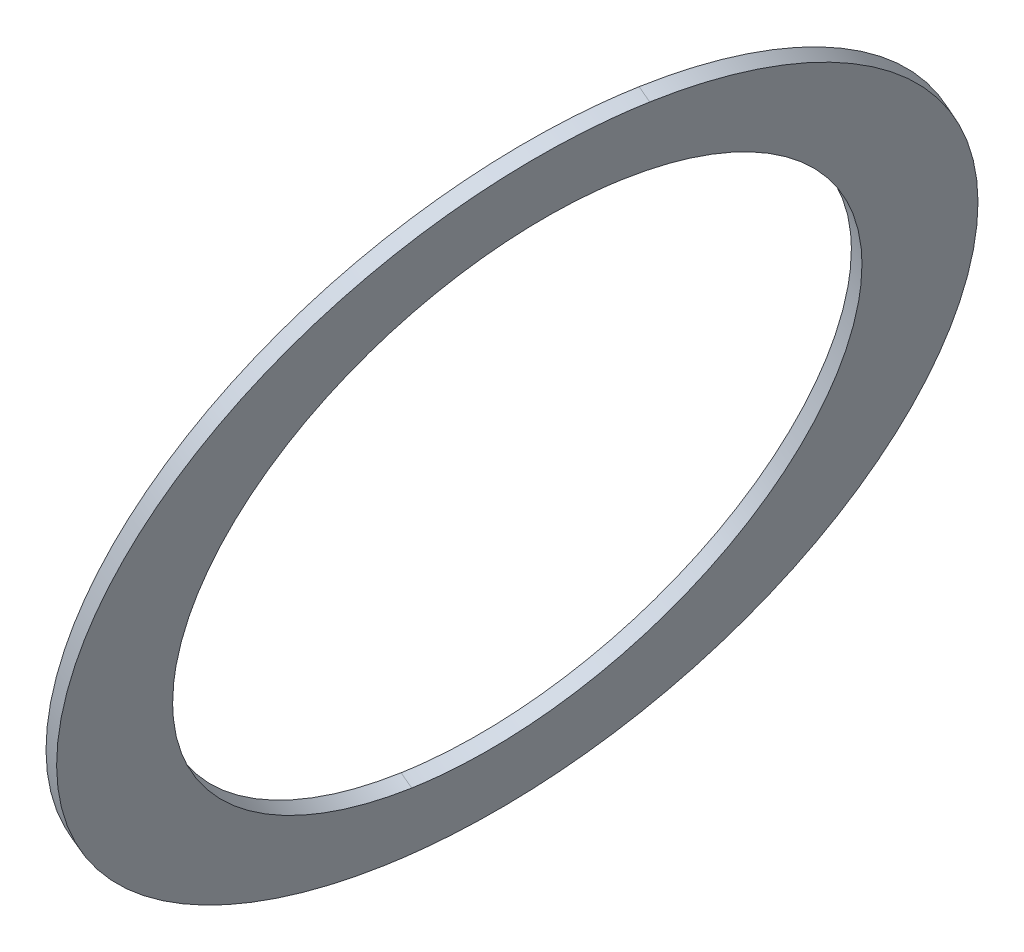
ISO-10303-21;
HEADER;
FILE_DESCRIPTION(('STEP AP214'),'2;1');
FILE_NAME('part.step','',(''),(''),'','','');
FILE_SCHEMA(('AUTOMOTIVE_DESIGN { 1 0 10303 214 1 1 1 1 }'));
ENDSEC;
DATA;
#1=APPLICATION_CONTEXT('core data for automotive mechanical design processes');
#2=APPLICATION_PROTOCOL_DEFINITION('international standard','automotive_design',2000,#1);
#3=PRODUCT_CONTEXT('',#1,'mechanical');
#4=PRODUCT('Part','Part','',(#3));
#5=PRODUCT_RELATED_PRODUCT_CATEGORY('part','',(#4));
#6=PRODUCT_DEFINITION_FORMATION('','',#4);
#7=PRODUCT_DEFINITION_CONTEXT('part definition',#1,'design');
#8=PRODUCT_DEFINITION('design','',#6,#7);
#9=PRODUCT_DEFINITION_SHAPE('','',#8);
#10=(LENGTH_UNIT() NAMED_UNIT(*) SI_UNIT(.MILLI.,.METRE.));
#11=(NAMED_UNIT(*) PLANE_ANGLE_UNIT() SI_UNIT($,.RADIAN.));
#12=(NAMED_UNIT(*) SI_UNIT($,.STERADIAN.) SOLID_ANGLE_UNIT());
#13=UNCERTAINTY_MEASURE_WITH_UNIT(LENGTH_MEASURE(1.E-05),#10,'distance_accuracy_value','');
#14=(GEOMETRIC_REPRESENTATION_CONTEXT(3) GLOBAL_UNCERTAINTY_ASSIGNED_CONTEXT((#13)) GLOBAL_UNIT_ASSIGNED_CONTEXT((#10,
#11,#12)) REPRESENTATION_CONTEXT('',''));
#15=CARTESIAN_POINT('',(0.,0.,0.));
#16=DIRECTION('',(0.,0.,1.));
#17=DIRECTION('',(1.,0.,0.));
#18=AXIS2_PLACEMENT_3D('',#15,#16,#17);
#19=CARTESIAN_POINT('',(-139.752487383921,70.7213654572873,-141.644211209351));
#20=CARTESIAN_POINT('',(-139.726119777532,70.7236637722229,-141.777262892946));
#21=CARTESIAN_POINT('',(-139.713229157618,70.6921218066896,-141.913488386246));
#22=CARTESIAN_POINT('',(-139.716476709013,70.626245339839,-142.04003074755));
#23=CARTESIAN_POINT('',(-139.754191040764,70.4155388145096,-142.301694580602));
#24=CARTESIAN_POINT('',(-139.850115538806,70.1138208715342,-142.456888314534));
#25=CARTESIAN_POINT('',(-139.920185079117,69.9219127484334,-142.508179353527));
#26=CARTESIAN_POINT('',(-140.054600427018,69.5897932797036,-142.528082146046));
#27=CARTESIAN_POINT('',(-140.199218907103,69.2892221478231,-142.425817143849));
#28=CARTESIAN_POINT('',(-140.25991642539,69.1731278579059,-142.360979551296));
#29=CARTESIAN_POINT('',(-140.349709533376,69.0202052321117,-142.224048410949));
#30=CARTESIAN_POINT('',(-140.422557749178,68.9296902859519,-142.039852227249));
#31=CARTESIAN_POINT('',(-140.445560045358,68.9068244483227,-141.96923830726));
#32=CARTESIAN_POINT('',(-140.464759160968,68.894715174402,-141.895098881138));
#33=CARTESIAN_POINT('',(-140.47966266488,68.8934161203519,-141.819895381166));
#34=B_SPLINE_CURVE_WITH_KNOTS('',5,(#19,#20,#21,#22,#23,#24,#25,#26,#27,#28,#29,#30,#31,#32,
#33),.UNSPECIFIED.,.F.,.F.,(6,3,3,3,6),(0.,0.249030806593906,0.604169804570402,0.8592427562129,
1.),.UNSPECIFIED.);
#35=DIRECTION('',(-0.909215143405846,0.378383579710355,-0.173648177666983));
#36=VECTOR('',#35,1.);
#37=SURFACE_OF_LINEAR_EXTRUSION('',#34,#36);
#38=DIRECTION('',(-0.909215143405846,0.378383579710355,-0.173648177666983));
#39=VECTOR('',#38,1.);
#40=CARTESIAN_POINT('',(-139.766125611072,70.7270412109829,-141.646815932016));
#41=LINE('',#40,#39);
#42=CARTESIAN_POINT('',(-139.752487383921,70.7213654572873,-141.644211209351));
#43=VERTEX_POINT('',#42);
#44=CARTESIAN_POINT('',(-139.779763838223,70.7327169646786,-141.649420654681));
#45=VERTEX_POINT('',#44);
#46=EDGE_CURVE('E41',#43,#45,#41,.T.);
#47=ORIENTED_EDGE('',*,*,#46,.F.);
#48=CARTESIAN_POINT('',(-139.752487383921,70.7213654572873,-141.644211209351));
#49=CARTESIAN_POINT('',(-139.726119777532,70.7236637722229,-141.777262892946));
#50=CARTESIAN_POINT('',(-139.713229157618,70.6921218066896,-141.913488386246));
#51=CARTESIAN_POINT('',(-139.716476709013,70.626245339839,-142.04003074755));
#52=CARTESIAN_POINT('',(-139.754191040764,70.4155388145096,-142.301694580602));
#53=CARTESIAN_POINT('',(-139.850115538806,70.1138208715342,-142.456888314534));
#54=CARTESIAN_POINT('',(-139.920185079117,69.9219127484334,-142.508179353527));
#55=CARTESIAN_POINT('',(-140.054600427018,69.5897932797036,-142.528082146046));
#56=CARTESIAN_POINT('',(-140.199218907103,69.2892221478231,-142.425817143849));
#57=CARTESIAN_POINT('',(-140.25991642539,69.1731278579059,-142.360979551296));
#58=CARTESIAN_POINT('',(-140.349709533376,69.0202052321117,-142.224048410949));
#59=CARTESIAN_POINT('',(-140.422557749178,68.9296902859519,-142.039852227249));
#60=CARTESIAN_POINT('',(-140.445560045358,68.9068244483227,-141.96923830726));
#61=CARTESIAN_POINT('',(-140.464759160968,68.894715174402,-141.895098881138));
#62=CARTESIAN_POINT('',(-140.47966266488,68.8934161203519,-141.819895381166));
#63=B_SPLINE_CURVE_WITH_KNOTS('',5,(#48,#49,#50,#51,#52,#53,#54,#55,#56,#57,#58,#59,#60,#61,
#62),.UNSPECIFIED.,.F.,.F.,(6,3,3,3,6),(0.,0.249030806593906,0.604169804570402,0.8592427562129,
1.),.UNSPECIFIED.);
#64=CARTESIAN_POINT('',(-140.47966266488,68.8934161203519,-141.819895381166));
#65=VERTEX_POINT('',#64);
#66=EDGE_CURVE('E11',#43,#65,#63,.T.);
#67=ORIENTED_EDGE('',*,*,#66,.T.);
#68=DIRECTION('',(-0.909215143405846,0.378383579710355,-0.173648177666983));
#69=VECTOR('',#68,1.);
#70=CARTESIAN_POINT('',(-140.493300892031,68.8990918740476,-141.822500103831));
#71=LINE('',#70,#69);
#72=CARTESIAN_POINT('',(-140.506939119182,68.9047676277433,-141.825104826496));
#73=VERTEX_POINT('',#72);
#74=EDGE_CURVE('E33',#65,#73,#71,.T.);
#75=ORIENTED_EDGE('',*,*,#74,.T.);
#76=CARTESIAN_POINT('',(-139.779763838223,70.7327169646786,-141.649420654681));
#77=CARTESIAN_POINT('',(-139.753396231834,70.7350152796143,-141.782472338276));
#78=CARTESIAN_POINT('',(-139.74050561192,70.7034733140809,-141.918697831576));
#79=CARTESIAN_POINT('',(-139.743753163315,70.6375968472303,-142.04524019288));
#80=CARTESIAN_POINT('',(-139.781467495066,70.4268903219009,-142.306904025932));
#81=CARTESIAN_POINT('',(-139.877391993108,70.1251723789255,-142.462097759864));
#82=CARTESIAN_POINT('',(-139.947461533419,69.9332642558247,-142.513388798857));
#83=CARTESIAN_POINT('',(-140.081876881321,69.6011447870949,-142.533291591376));
#84=CARTESIAN_POINT('',(-140.226495361405,69.3005736552144,-142.431026589179));
#85=CARTESIAN_POINT('',(-140.287192879692,69.1844793652972,-142.366188996626));
#86=CARTESIAN_POINT('',(-140.376985987678,69.031556739503,-142.229257856279));
#87=CARTESIAN_POINT('',(-140.44983420348,68.9410417933433,-142.045061672579));
#88=CARTESIAN_POINT('',(-140.47283649966,68.918175955714,-141.97444775259));
#89=CARTESIAN_POINT('',(-140.49203561527,68.9060666817934,-141.900308326468));
#90=CARTESIAN_POINT('',(-140.506939119182,68.9047676277433,-141.825104826496));
#91=B_SPLINE_CURVE_WITH_KNOTS('',5,(#76,#77,#78,#79,#80,#81,#82,#83,#84,#85,#86,#87,#88,#89,
#90),.UNSPECIFIED.,.F.,.F.,(6,3,3,3,6),(0.,0.249030806593906,0.604169804570402,0.8592427562129,
1.),.UNSPECIFIED.);
#92=EDGE_CURVE('E67',#45,#73,#91,.T.);
#93=ORIENTED_EDGE('',*,*,#92,.F.);
#94=EDGE_LOOP('',(#47,#67,#75,#93));
#95=FACE_BOUND('',#94,.T.);
#96=ADVANCED_FACE('F17',(#95),#37,.T.);
#97=CARTESIAN_POINT('',(-140.47966266488,68.8934161203519,-141.819895381166));
#98=CARTESIAN_POINT('',(-140.506030271268,68.8911178054171,-141.686843697572));
#99=CARTESIAN_POINT('',(-140.51892089118,68.9226597709554,-141.550618204275));
#100=CARTESIAN_POINT('',(-140.515673339788,68.9885362378002,-141.424075842968));
#101=CARTESIAN_POINT('',(-140.477959008045,69.1992427631126,-141.162412009907));
#102=CARTESIAN_POINT('',(-140.382034510012,69.5009607060702,-141.007218275966));
#103=CARTESIAN_POINT('',(-140.311964969694,69.6928688291856,-140.95592723698));
#104=CARTESIAN_POINT('',(-140.177549621791,70.0249882979593,-140.936024444371));
#105=CARTESIAN_POINT('',(-140.032931141706,70.3255594297991,-141.03828944666));
#106=CARTESIAN_POINT('',(-139.972233623443,70.4416537196698,-141.10312703919));
#107=CARTESIAN_POINT('',(-139.882440515446,70.5945763454853,-141.240058179547));
#108=CARTESIAN_POINT('',(-139.809592299632,70.6850912916678,-141.424254363258));
#109=CARTESIAN_POINT('',(-139.786590003446,70.7079571293108,-141.494868283255));
#110=CARTESIAN_POINT('',(-139.767390887834,70.7200664032762,-141.569007709287));
#111=CARTESIAN_POINT('',(-139.752487383921,70.7213654572873,-141.644211209351));
#112=B_SPLINE_CURVE_WITH_KNOTS('',5,(#97,#98,#99,#100,#101,#102,#103,#104,#105,#106,#107,#108,
#109,#110,#111),.UNSPECIFIED.,.F.,.F.,(6,3,3,3,6),(0.,0.249030806576429,0.604169804532782,
0.859242756203596,1.),.UNSPECIFIED.);
#113=DIRECTION('',(-0.909215143405846,0.378383579710355,-0.173648177666983));
#114=VECTOR('',#113,1.);
#115=SURFACE_OF_LINEAR_EXTRUSION('',#112,#114);
#116=ORIENTED_EDGE('',*,*,#74,.F.);
#117=CARTESIAN_POINT('',(-140.47966266488,68.8934161203519,-141.819895381166));
#118=CARTESIAN_POINT('',(-140.506030271268,68.8911178054171,-141.686843697572));
#119=CARTESIAN_POINT('',(-140.51892089118,68.9226597709554,-141.550618204275));
#120=CARTESIAN_POINT('',(-140.515673339788,68.9885362378002,-141.424075842968));
#121=CARTESIAN_POINT('',(-140.477959008045,69.1992427631126,-141.162412009907));
#122=CARTESIAN_POINT('',(-140.382034510012,69.5009607060702,-141.007218275966));
#123=CARTESIAN_POINT('',(-140.311964969694,69.6928688291856,-140.95592723698));
#124=CARTESIAN_POINT('',(-140.177549621791,70.0249882979593,-140.936024444371));
#125=CARTESIAN_POINT('',(-140.032931141706,70.3255594297991,-141.03828944666));
#126=CARTESIAN_POINT('',(-139.972233623443,70.4416537196698,-141.10312703919));
#127=CARTESIAN_POINT('',(-139.882440515446,70.5945763454853,-141.240058179547));
#128=CARTESIAN_POINT('',(-139.809592299632,70.6850912916678,-141.424254363258));
#129=CARTESIAN_POINT('',(-139.786590003446,70.7079571293108,-141.494868283255));
#130=CARTESIAN_POINT('',(-139.767390887834,70.7200664032762,-141.569007709287));
#131=CARTESIAN_POINT('',(-139.752487383921,70.7213654572873,-141.644211209351));
#132=B_SPLINE_CURVE_WITH_KNOTS('',5,(#117,#118,#119,#120,#121,#122,#123,#124,#125,#126,#127,
#128,#129,#130,#131),.UNSPECIFIED.,.F.,.F.,(6,3,3,3,6),(0.,0.249030806576429,0.604169804532782,
0.859242756203596,1.),.UNSPECIFIED.);
#133=EDGE_CURVE('E107',#65,#43,#132,.T.);
#134=ORIENTED_EDGE('',*,*,#133,.T.);
#135=ORIENTED_EDGE('',*,*,#46,.T.);
#136=CARTESIAN_POINT('',(-140.506939119182,68.9047676277433,-141.825104826496));
#137=CARTESIAN_POINT('',(-140.53330672557,68.9024693128084,-141.692053142902));
#138=CARTESIAN_POINT('',(-140.546197345482,68.9340112783467,-141.555827649605));
#139=CARTESIAN_POINT('',(-140.54294979409,68.9998877451915,-141.429285288298));
#140=CARTESIAN_POINT('',(-140.505235462347,69.2105942705039,-141.167621455237));
#141=CARTESIAN_POINT('',(-140.409310964315,69.5123122134615,-141.012427721296));
#142=CARTESIAN_POINT('',(-140.339241423996,69.7042203365769,-140.96113668231));
#143=CARTESIAN_POINT('',(-140.204826076093,70.0363398053506,-140.941233889701));
#144=CARTESIAN_POINT('',(-140.060207596008,70.3369109371904,-141.04349889199));
#145=CARTESIAN_POINT('',(-139.999510077745,70.4530052270611,-141.10833648452));
#146=CARTESIAN_POINT('',(-139.909716969748,70.6059278528767,-141.245267624877));
#147=CARTESIAN_POINT('',(-139.836868753934,70.6964427990591,-141.429463808588));
#148=CARTESIAN_POINT('',(-139.813866457748,70.7193086367021,-141.500077728585));
#149=CARTESIAN_POINT('',(-139.794667342136,70.7314179106675,-141.574217154617));
#150=CARTESIAN_POINT('',(-139.779763838223,70.7327169646786,-141.649420654681));
#151=B_SPLINE_CURVE_WITH_KNOTS('',5,(#136,#137,#138,#139,#140,#141,#142,#143,#144,#145,#146,
#147,#148,#149,#150),.UNSPECIFIED.,.F.,.F.,(6,3,3,3,6),(0.,0.249030806576429,0.604169804532782,
0.859242756203596,1.),.UNSPECIFIED.);
#152=EDGE_CURVE('E129',#73,#45,#151,.T.);
#153=ORIENTED_EDGE('',*,*,#152,.F.);
#154=EDGE_LOOP('',(#116,#134,#135,#153));
#155=FACE_BOUND('',#154,.T.);
#156=ADVANCED_FACE('F141',(#155),#115,.T.);
#157=CARTESIAN_POINT('',(-140.1160750244,69.8073907888192,-141.732053295259));
#158=DIRECTION('',(-0.909215143405846,0.378383579710355,-0.173648177666983));
#159=DIRECTION('',(0.368170072341653,0.925493835169846,0.088949192770661));
#160=AXIS2_PLACEMENT_3D('',#157,#158,#159);
#161=ELLIPSE('',#160,0.787553491698,0.581350260673);
#162=DIRECTION('',(-0.909215143405846,0.378383579710355,-0.173648177666983));
#163=VECTOR('',#162,1.);
#164=SURFACE_OF_LINEAR_EXTRUSION('',#161,#163);
#165=CARTESIAN_POINT('',(-140.43330510471,69.0898663947781,-141.807314987959));
#166=CARTESIAN_POINT('',(-140.435794712537,69.089647766405,-141.794755894165));
#167=CARTESIAN_POINT('',(-140.43807043931,69.0899635049047,-141.782152274949));
#168=CARTESIAN_POINT('',(-140.442183866031,69.091644827737,-141.756950888579));
#169=CARTESIAN_POINT('',(-140.444021818301,69.0930098053857,-141.744353122252));
#170=CARTESIAN_POINT('',(-140.448843100628,69.0986223585535,-141.706879185302));
#171=CARTESIAN_POINT('',(-140.451171791134,69.1043849269532,-141.682129475922));
#172=CARTESIAN_POINT('',(-140.454098764415,69.1195531720544,-141.633751984009));
#173=CARTESIAN_POINT('',(-140.454700422686,69.1289517013694,-141.610122101841));
#174=CARTESIAN_POINT('',(-140.454319627359,69.1508749977946,-141.564344538209));
#175=CARTESIAN_POINT('',(-140.453334332549,69.163405338018,-141.542199589276));
#176=CARTESIAN_POINT('',(-140.449274438426,69.1965377215338,-141.491260772749));
#177=CARTESIAN_POINT('',(-140.445525452944,69.2183690149399,-141.463319399332));
#178=CARTESIAN_POINT('',(-140.435753215705,69.2657481173381,-141.411246245397));
#179=CARTESIAN_POINT('',(-140.429725588507,69.2913030180016,-141.387121921598));
#180=CARTESIAN_POINT('',(-140.413509754728,69.3540325813771,-141.335338164175));
#181=CARTESIAN_POINT('',(-140.402604601005,69.3922474262468,-141.309166055982));
#182=CARTESIAN_POINT('',(-140.378292164666,69.4716605565457,-141.26342190057));
#183=CARTESIAN_POINT('',(-140.364883016268,69.5128610525505,-141.24385480562));
#184=CARTESIAN_POINT('',(-140.335796787811,69.5979701518241,-141.210694386957));
#185=CARTESIAN_POINT('',(-140.320076243481,69.6419184242781,-141.197242200374));
#186=CARTESIAN_POINT('',(-140.287030615409,69.7307065313996,-141.176796397893));
#187=CARTESIAN_POINT('',(-140.26970476896,69.7755467818336,-141.169805869532));
#188=CARTESIAN_POINT('',(-140.230137797134,69.8744218004071,-141.16152594671));
#189=CARTESIAN_POINT('',(-140.207613929266,69.9284706558396,-141.16168628445));
#190=CARTESIAN_POINT('',(-140.161301806976,70.0351371767111,-141.171745836642));
#191=CARTESIAN_POINT('',(-140.137514115425,70.0877554637572,-141.181640749432));
#192=CARTESIAN_POINT('',(-140.095687826254,70.176198619516,-141.207921806287));
#193=CARTESIAN_POINT('',(-140.07778275883,70.2128003276598,-141.221916039498));
#194=CARTESIAN_POINT('',(-140.04202476229,70.283073187706,-141.256017264694));
#195=CARTESIAN_POINT('',(-140.024171795641,70.3167489618572,-141.276114381209));
#196=CARTESIAN_POINT('',(-139.993285604356,70.3721066877488,-141.317207460597));
#197=CARTESIAN_POINT('',(-139.980122197764,70.394729403119,-141.336835104455));
#198=CARTESIAN_POINT('',(-139.954515566562,70.4364825038102,-141.379929418818));
#199=CARTESIAN_POINT('',(-139.942071548543,70.4556167886923,-141.403391746343));
#200=CARTESIAN_POINT('',(-139.920547776312,70.4862304906505,-141.44938138832));
#201=CARTESIAN_POINT('',(-139.911266980835,70.4984687149413,-141.471307887782));
#202=CARTESIAN_POINT('',(-139.893863105723,70.5191941718275,-141.517272632965));
#203=CARTESIAN_POINT('',(-139.88573776621,70.5276887965688,-141.541306603653));
#204=CARTESIAN_POINT('',(-139.873503991241,70.5382164245309,-141.582422220328));
#205=CARTESIAN_POINT('',(-139.86897152741,70.5414654732721,-141.599074269877));
#206=CARTESIAN_POINT('',(-139.860623777559,70.5460238774566,-141.632849892307));
#207=CARTESIAN_POINT('',(-139.856809832296,70.5473296374296,-141.649974279657));
#208=CARTESIAN_POINT('',(-139.853397852695,70.5476181976434,-141.667210493219));
#209=B_SPLINE_CURVE_WITH_KNOTS('',3,(#165,#166,#167,#168,#169,#170,#171,#172,#173,#174,#175,
#176,#177,#178,#179,#180,#181,#182,#183,#184,#185,#186,#187,#188,#189,#190,#191,#192,#193,#194,
#195,#196,#197,#198,#199,#200,#201,#202,#203,#204,#205,#206,#207,#208),.UNSPECIFIED.,.F.,.F.,(4,
2,2,2,2,2,2,2,2,2,2,2,2,2,2,2,2,2,2,2,2,4),(0.,0.038389818862311,0.0767574569072895,
0.152911164042007,0.228915926588675,0.30505691612097,0.411438907219723,0.518026218942819,
0.66001675684288,0.802113520331967,0.947341478504651,1.09263879431561,1.26750509902442,
1.44229416585948,1.57110928755966,1.69971706598271,1.79751998640008,1.89521289781242,
1.97520526810684,2.0550389691591,2.10760170512493,2.16026157221004),.UNSPECIFIED.);
#210=CARTESIAN_POINT('',(-140.433305104712,69.089866394774,-141.807314987959));
#211=VERTEX_POINT('',#210);
#212=CARTESIAN_POINT('',(-139.853397852693,70.5476181976482,-141.667210493219));
#213=VERTEX_POINT('',#212);
#214=EDGE_CURVE('E72',#211,#213,#209,.T.);
#215=ORIENTED_EDGE('',*,*,#214,.T.);
#216=DIRECTION('',(-0.909215143405846,0.378383579710355,-0.173648177666983));
#217=VECTOR('',#216,1.);
#218=CARTESIAN_POINT('',(-139.83975962554,70.5419424439573,-141.664605770554));
#219=LINE('',#218,#217);
#220=CARTESIAN_POINT('',(-139.826121398391,70.536266690257,-141.662001047889));
#221=VERTEX_POINT('',#220);
#222=EDGE_CURVE('E69',#221,#213,#219,.T.);
#223=ORIENTED_EDGE('',*,*,#222,.F.);
#224=CARTESIAN_POINT('',(-140.406028650408,69.0785148873868,-141.802105542629));
#225=CARTESIAN_POINT('',(-140.408518258235,69.0782962590138,-141.789546448835));
#226=CARTESIAN_POINT('',(-140.410793985008,69.0786119975135,-141.776942829619));
#227=CARTESIAN_POINT('',(-140.414907411729,69.0802933203458,-141.751741443249));
#228=CARTESIAN_POINT('',(-140.416745363999,69.0816582979944,-141.739143676922));
#229=CARTESIAN_POINT('',(-140.421566646326,69.0872708511622,-141.701669739972));
#230=CARTESIAN_POINT('',(-140.423895336832,69.0930334195619,-141.676920030592));
#231=CARTESIAN_POINT('',(-140.426822310113,69.1082016646631,-141.628542538679));
#232=CARTESIAN_POINT('',(-140.427423968384,69.1176001939781,-141.604912656511));
#233=CARTESIAN_POINT('',(-140.427043173057,69.1395234904032,-141.559135092879));
#234=CARTESIAN_POINT('',(-140.426057878247,69.1520538306266,-141.536990143946));
#235=CARTESIAN_POINT('',(-140.421997984124,69.1851862141424,-141.486051327419));
#236=CARTESIAN_POINT('',(-140.418248998642,69.2070175075484,-141.458109954002));
#237=CARTESIAN_POINT('',(-140.408476761403,69.2543966099467,-141.406036800067));
#238=CARTESIAN_POINT('',(-140.402449134205,69.2799515106101,-141.381912476268));
#239=CARTESIAN_POINT('',(-140.386233300426,69.3426810739855,-141.330128718845));
#240=CARTESIAN_POINT('',(-140.375328146703,69.3808959188553,-141.303956610652));
#241=CARTESIAN_POINT('',(-140.351015710364,69.4603090491541,-141.25821245524));
#242=CARTESIAN_POINT('',(-140.337606561966,69.5015095451589,-141.23864536029));
#243=CARTESIAN_POINT('',(-140.308520333509,69.5866186444325,-141.205484941627));
#244=CARTESIAN_POINT('',(-140.292799789179,69.6305669168865,-141.192032755044));
#245=CARTESIAN_POINT('',(-140.259754161107,69.7193550240079,-141.171586952563));
#246=CARTESIAN_POINT('',(-140.242428314658,69.7641952744419,-141.164596424202));
#247=CARTESIAN_POINT('',(-140.202861342833,69.8630702930154,-141.15631650138));
#248=CARTESIAN_POINT('',(-140.180337474964,69.9171191484479,-141.15647683912));
#249=CARTESIAN_POINT('',(-140.134025352675,70.0237856693193,-141.166536391312));
#250=CARTESIAN_POINT('',(-140.110237661124,70.0764039563655,-141.176431304102));
#251=CARTESIAN_POINT('',(-140.068411371952,70.1648471121243,-141.202712360957));
#252=CARTESIAN_POINT('',(-140.050506304528,70.2014488202682,-141.216706594168));
#253=CARTESIAN_POINT('',(-140.014748307988,70.2717216803144,-141.250807819364));
#254=CARTESIAN_POINT('',(-139.996895341339,70.3053974544656,-141.270904935879));
#255=CARTESIAN_POINT('',(-139.966009150054,70.3607551803573,-141.311998015267));
#256=CARTESIAN_POINT('',(-139.952845743462,70.3833778957275,-141.331625659125));
#257=CARTESIAN_POINT('',(-139.92723911226,70.4251309964188,-141.374719973488));
#258=CARTESIAN_POINT('',(-139.914795094241,70.4442652813008,-141.398182301013));
#259=CARTESIAN_POINT('',(-139.89327132201,70.4748789832591,-141.44417194299));
#260=CARTESIAN_POINT('',(-139.883990526533,70.48711720755,-141.466098442452));
#261=CARTESIAN_POINT('',(-139.866586651421,70.5078426644361,-141.512063187635));
#262=CARTESIAN_POINT('',(-139.858461311908,70.5163372891775,-141.536097158323));
#263=CARTESIAN_POINT('',(-139.846227536939,70.5268649171396,-141.577212774997));
#264=CARTESIAN_POINT('',(-139.841695073108,70.5301139658809,-141.593864824547));
#265=CARTESIAN_POINT('',(-139.833347323257,70.5346723700653,-141.627640446977));
#266=CARTESIAN_POINT('',(-139.829533377993,70.5359781300383,-141.644764834327));
#267=CARTESIAN_POINT('',(-139.826121398393,70.5362666902521,-141.662001047889));
#268=B_SPLINE_CURVE_WITH_KNOTS('',3,(#224,#225,#226,#227,#228,#229,#230,#231,#232,#233,#234,
#235,#236,#237,#238,#239,#240,#241,#242,#243,#244,#245,#246,#247,#248,#249,#250,#251,#252,#253,
#254,#255,#256,#257,#258,#259,#260,#261,#262,#263,#264,#265,#266,#267),.UNSPECIFIED.,.F.,.F.,(4,
2,2,2,2,2,2,2,2,2,2,2,2,2,2,2,2,2,2,2,2,4),(0.,0.0383898188622973,0.0767574569072182,
0.152911164041937,0.228915926588594,0.305056916120877,0.411438907219628,0.518026218942659,
0.66001675684261,0.802113520331638,0.947341478504317,1.09263879431523,1.26750509902404,
1.44229416585911,1.57110928755936,1.69971706598251,1.79751998639994,1.89521289781233,
1.97520526810675,2.05503896915901,2.10760170512495,2.16026157221014),.UNSPECIFIED.);
#269=CARTESIAN_POINT('',(-140.40602865041,69.0785148873827,-141.802105542629));
#270=VERTEX_POINT('',#269);
#271=EDGE_CURVE('E22',#270,#221,#268,.T.);
#272=ORIENTED_EDGE('',*,*,#271,.F.);
#273=DIRECTION('',(-0.909215143405846,0.378383579710355,-0.173648177666983));
#274=VECTOR('',#273,1.);
#275=CARTESIAN_POINT('',(-140.419666877562,69.084190641074,-141.804710265294));
#276=LINE('',#275,#274);
#277=EDGE_CURVE('E79',#270,#211,#276,.T.);
#278=ORIENTED_EDGE('',*,*,#277,.T.);
#279=EDGE_LOOP('',(#215,#223,#272,#278));
#280=FACE_BOUND('',#279,.T.);
#281=ADVANCED_FACE('F70',(#280),#164,.F.);
#282=CARTESIAN_POINT('',(-140.1160750244,69.8073907888192,-141.732053295259));
#283=DIRECTION('',(-0.909215143405846,0.378383579710355,-0.173648177666983));
#284=DIRECTION('',(0.368170072341653,0.925493835169846,0.088949192770661));
#285=AXIS2_PLACEMENT_3D('',#282,#283,#284);
#286=ELLIPSE('',#285,0.787553491698,0.581350260673);
#287=DIRECTION('',(-0.909215143405846,0.378383579710355,-0.173648177666983));
#288=VECTOR('',#287,1.);
#289=SURFACE_OF_LINEAR_EXTRUSION('',#286,#288);
#290=CARTESIAN_POINT('',(-139.853397852695,70.5476181976434,-141.667210493219));
#291=CARTESIAN_POINT('',(-139.850908244869,70.5478368260165,-141.679769587013));
#292=CARTESIAN_POINT('',(-139.848632518095,70.5475210875167,-141.692373206229));
#293=CARTESIAN_POINT('',(-139.844519091374,70.5458397646845,-141.717574592599));
#294=CARTESIAN_POINT('',(-139.842681139104,70.5444747870358,-141.730172358926));
#295=CARTESIAN_POINT('',(-139.837859856777,70.5388622338681,-141.767646295876));
#296=CARTESIAN_POINT('',(-139.835531166271,70.5330996654683,-141.792396005256));
#297=CARTESIAN_POINT('',(-139.83260419299,70.5179314203671,-141.840773497169));
#298=CARTESIAN_POINT('',(-139.83200253472,70.5085328910522,-141.864403379337));
#299=CARTESIAN_POINT('',(-139.832383330047,70.486609594627,-141.910180942969));
#300=CARTESIAN_POINT('',(-139.833368624857,70.4740792544036,-141.932325891902));
#301=CARTESIAN_POINT('',(-139.837428518979,70.4409468708878,-141.983264708429));
#302=CARTESIAN_POINT('',(-139.841177504462,70.4191155774818,-142.011206081846));
#303=CARTESIAN_POINT('',(-139.850949741701,70.3717364750835,-142.063279235781));
#304=CARTESIAN_POINT('',(-139.856977368898,70.3461815744201,-142.08740355958));
#305=CARTESIAN_POINT('',(-139.873193202677,70.2834520110446,-142.139187317003));
#306=CARTESIAN_POINT('',(-139.8840983564,70.2452371661749,-142.165359425196));
#307=CARTESIAN_POINT('',(-139.908410792739,70.165824035876,-142.211103580608));
#308=CARTESIAN_POINT('',(-139.921819941138,70.1246235398712,-142.230670675558));
#309=CARTESIAN_POINT('',(-139.950906169594,70.0395144405976,-142.263831094222));
#310=CARTESIAN_POINT('',(-139.966626713924,69.9955661681437,-142.277283280804));
#311=CARTESIAN_POINT('',(-139.999672341996,69.9067780610222,-142.297729083285));
#312=CARTESIAN_POINT('',(-140.016998188445,69.8619378105882,-142.304719611646));
#313=CARTESIAN_POINT('',(-140.056565160271,69.7630627920147,-142.312999534468));
#314=CARTESIAN_POINT('',(-140.079089028139,69.7090139365822,-142.312839196728));
#315=CARTESIAN_POINT('',(-140.125401150429,69.6023474157108,-142.302779644536));
#316=CARTESIAN_POINT('',(-140.14918884198,69.5497291286647,-142.292884731746));
#317=CARTESIAN_POINT('',(-140.191015131151,69.4612859729059,-142.266603674891));
#318=CARTESIAN_POINT('',(-140.208920198575,69.424684264762,-142.252609441681));
#319=CARTESIAN_POINT('',(-140.244678195116,69.3544114047157,-142.218508216485));
#320=CARTESIAN_POINT('',(-140.262531161765,69.3207356305645,-142.198411099969));
#321=CARTESIAN_POINT('',(-140.293417353049,69.2653779046729,-142.157318020581));
#322=CARTESIAN_POINT('',(-140.306580759641,69.2427551893027,-142.137690376723));
#323=CARTESIAN_POINT('',(-140.332187390843,69.2010020886114,-142.09459606236));
#324=CARTESIAN_POINT('',(-140.344631408862,69.1818678037293,-142.071133734835));
#325=CARTESIAN_POINT('',(-140.366155181093,69.1512541017711,-142.025144092858));
#326=CARTESIAN_POINT('',(-140.375435976571,69.1390158774803,-142.003217593397));
#327=CARTESIAN_POINT('',(-140.392839851683,69.1182904205941,-141.957252848213));
#328=CARTESIAN_POINT('',(-140.400965191195,69.1097957958527,-141.933218877525));
#329=CARTESIAN_POINT('',(-140.413198966165,69.0992681678906,-141.892103260851));
#330=CARTESIAN_POINT('',(-140.417731429995,69.0960191191493,-141.875451211302));
#331=CARTESIAN_POINT('',(-140.426079179846,69.0914607149649,-141.841675588871));
#332=CARTESIAN_POINT('',(-140.42989312511,69.0901549549918,-141.824551201521));
#333=CARTESIAN_POINT('',(-140.43330510471,69.0898663947781,-141.807314987959));
#334=B_SPLINE_CURVE_WITH_KNOTS('',3,(#290,#291,#292,#293,#294,#295,#296,#297,#298,#299,#300,
#301,#302,#303,#304,#305,#306,#307,#308,#309,#310,#311,#312,#313,#314,#315,#316,#317,#318,#319,
#320,#321,#322,#323,#324,#325,#326,#327,#328,#329,#330,#331,#332,#333),.UNSPECIFIED.,.F.,.F.,(4,
2,2,2,2,2,2,2,2,2,2,2,2,2,2,2,2,2,2,2,2,4),(0.,0.0383898188623019,0.0767574569072526,
0.152911164041978,0.228915926588646,0.305056916120903,0.411438907219625,0.518026218942705,
0.660016756842788,0.802113520331917,0.947341478504517,1.09263879431541,1.26750509902423,
1.44229416585925,1.57110928755952,1.69971706598265,1.79751998639994,1.89521289781223,
1.97520526810678,2.05503896915917,2.10760170512509,2.16026157221027),.UNSPECIFIED.);
#335=EDGE_CURVE('E76',#213,#211,#334,.T.);
#336=ORIENTED_EDGE('',*,*,#335,.T.);
#337=ORIENTED_EDGE('',*,*,#277,.F.);
#338=CARTESIAN_POINT('',(-139.826121398393,70.5362666902521,-141.662001047889));
#339=CARTESIAN_POINT('',(-139.823631790567,70.5364853186252,-141.674560141683));
#340=CARTESIAN_POINT('',(-139.821356063793,70.5361695801255,-141.687163760899));
#341=CARTESIAN_POINT('',(-139.817242637072,70.5344882572932,-141.712365147269));
#342=CARTESIAN_POINT('',(-139.815404684802,70.5331232796446,-141.724962913596));
#343=CARTESIAN_POINT('',(-139.810583402475,70.5275107264768,-141.762436850546));
#344=CARTESIAN_POINT('',(-139.808254711969,70.521748158077,-141.787186559926));
#345=CARTESIAN_POINT('',(-139.805327738688,70.5065799129758,-141.835564051839));
#346=CARTESIAN_POINT('',(-139.804726080418,70.4971813836609,-141.859193934007));
#347=CARTESIAN_POINT('',(-139.805106875745,70.4752580872358,-141.904971497639));
#348=CARTESIAN_POINT('',(-139.806092170555,70.4627277470124,-141.927116446572));
#349=CARTESIAN_POINT('',(-139.810152064677,70.4295953634966,-141.978055263099));
#350=CARTESIAN_POINT('',(-139.81390105016,70.4077640700906,-142.005996636516));
#351=CARTESIAN_POINT('',(-139.823673287399,70.3603849676923,-142.058069790451));
#352=CARTESIAN_POINT('',(-139.829700914596,70.3348300670289,-142.08219411425));
#353=CARTESIAN_POINT('',(-139.845916748375,70.2721005036535,-142.133977871673));
#354=CARTESIAN_POINT('',(-139.856821902098,70.2338856587837,-142.160149979866));
#355=CARTESIAN_POINT('',(-139.881134338437,70.1544725284848,-142.205894135278));
#356=CARTESIAN_POINT('',(-139.894543486835,70.11327203248,-142.225461230228));
#357=CARTESIAN_POINT('',(-139.923629715292,70.0281629332064,-142.258621648892));
#358=CARTESIAN_POINT('',(-139.939350259622,69.9842146607524,-142.272073835474));
#359=CARTESIAN_POINT('',(-139.972395887694,69.895426553631,-142.292519637955));
#360=CARTESIAN_POINT('',(-139.989721734143,69.850586303197,-142.299510166316));
#361=CARTESIAN_POINT('',(-140.029288705969,69.7517112846235,-142.307790089138));
#362=CARTESIAN_POINT('',(-140.051812573837,69.6976624291911,-142.307629751398));
#363=CARTESIAN_POINT('',(-140.098124696127,69.5909959083196,-142.297570199206));
#364=CARTESIAN_POINT('',(-140.121912387678,69.5383776212734,-142.287675286416));
#365=CARTESIAN_POINT('',(-140.163738676849,69.4499344655146,-142.261394229561));
#366=CARTESIAN_POINT('',(-140.181643744273,69.4133327573708,-142.247399996351));
#367=CARTESIAN_POINT('',(-140.217401740814,69.3430598973246,-142.213298771155));
#368=CARTESIAN_POINT('',(-140.235254707463,69.3093841231734,-142.19320165464));
#369=CARTESIAN_POINT('',(-140.266140898747,69.2540263972817,-142.152108575251));
#370=CARTESIAN_POINT('',(-140.279304305339,69.2314036819115,-142.132480931393));
#371=CARTESIAN_POINT('',(-140.304910936541,69.1896505812202,-142.08938661703));
#372=CARTESIAN_POINT('',(-140.31735495456,69.1705162963382,-142.065924289505));
#373=CARTESIAN_POINT('',(-140.338878726791,69.1399025943799,-142.019934647528));
#374=CARTESIAN_POINT('',(-140.348159522269,69.1276643700891,-141.998008148067));
#375=CARTESIAN_POINT('',(-140.36556339738,69.1069389132029,-141.952043402883));
#376=CARTESIAN_POINT('',(-140.373688736893,69.0984442884615,-141.928009432195));
#377=CARTESIAN_POINT('',(-140.385922511862,69.0879166604993,-141.886893815521));
#378=CARTESIAN_POINT('',(-140.390454975693,69.0846676117581,-141.870241765972));
#379=CARTESIAN_POINT('',(-140.398802725544,69.0801092075736,-141.836466143541));
#380=CARTESIAN_POINT('',(-140.402616670808,69.0788034476006,-141.819341756191));
#381=CARTESIAN_POINT('',(-140.406028650408,69.0785148873868,-141.802105542629));
#382=B_SPLINE_CURVE_WITH_KNOTS('',3,(#338,#339,#340,#341,#342,#343,#344,#345,#346,#347,#348,
#349,#350,#351,#352,#353,#354,#355,#356,#357,#358,#359,#360,#361,#362,#363,#364,#365,#366,#367,
#368,#369,#370,#371,#372,#373,#374,#375,#376,#377,#378,#379,#380,#381),.UNSPECIFIED.,.F.,.F.,(4,
2,2,2,2,2,2,2,2,2,2,2,2,2,2,2,2,2,2,2,2,4),(0.,0.0383898188623058,0.0767574569072267,
0.152911164041985,0.228915926588632,0.305056916120869,0.411438907219572,0.518026218942642,
0.660016756842713,0.802113520331838,0.94734147850447,1.09263879431539,1.26750509902415,
1.44229416585907,1.57110928755936,1.69971706598255,1.79751998639988,1.89521289781223,
1.97520526810665,2.05503896915893,2.10760170512498,2.1602615722103),.UNSPECIFIED.);
#383=EDGE_CURVE('E66',#221,#270,#382,.T.);
#384=ORIENTED_EDGE('',*,*,#383,.F.);
#385=ORIENTED_EDGE('',*,*,#222,.T.);
#386=EDGE_LOOP('',(#336,#337,#384,#385));
#387=FACE_BOUND('',#386,.T.);
#388=ADVANCED_FACE('F78',(#387),#289,.F.);
#389=CARTESIAN_POINT('',(-140.197105636582,63.1845344254721,-155.739144366844));
#390=DIRECTION('',(-0.909215143405846,0.378383579710355,-0.173648177666983));
#391=DIRECTION('',(-0.015180111181639,-0.4469491584612,-0.894430552908015));
#392=AXIS2_PLACEMENT_3D('',#389,#390,#391);
#393=PLANE('',#392);
#394=ORIENTED_EDGE('',*,*,#133,.F.);
#395=ORIENTED_EDGE('',*,*,#66,.F.);
#396=EDGE_LOOP('',(#394,#395));
#397=FACE_BOUND('',#396,.T.);
#398=ORIENTED_EDGE('',*,*,#383,.T.);
#399=ORIENTED_EDGE('',*,*,#271,.T.);
#400=EDGE_LOOP('',(#398,#399));
#401=FACE_BOUND('',#400,.T.);
#402=ADVANCED_FACE('F64',(#397,#401),#393,.F.);
#403=CARTESIAN_POINT('',(-140.224382090884,63.1958859328634,-155.744353812174));
#404=DIRECTION('',(-0.909215143405846,0.378383579710355,-0.173648177666983));
#405=DIRECTION('',(-0.015180111181639,-0.4469491584612,-0.894430552908015));
#406=AXIS2_PLACEMENT_3D('',#403,#404,#405);
#407=PLANE('',#406);
#408=ORIENTED_EDGE('',*,*,#92,.T.);
#409=ORIENTED_EDGE('',*,*,#152,.T.);
#410=EDGE_LOOP('',(#408,#409));
#411=FACE_BOUND('',#410,.T.);
#412=ORIENTED_EDGE('',*,*,#214,.F.);
#413=ORIENTED_EDGE('',*,*,#335,.F.);
#414=EDGE_LOOP('',(#412,#413));
#415=FACE_BOUND('',#414,.T.);
#416=ADVANCED_FACE('F19',(#411,#415),#407,.T.);
#417=CLOSED_SHELL('',(#96,#156,#281,#388,#402,#416));
#418=MANIFOLD_SOLID_BREP('B1',#417);
#419=ADVANCED_BREP_SHAPE_REPRESENTATION('',(#18,#418),#14);
#420=SHAPE_DEFINITION_REPRESENTATION(#9,#419);
ENDSEC;
END-ISO-10303-21;
